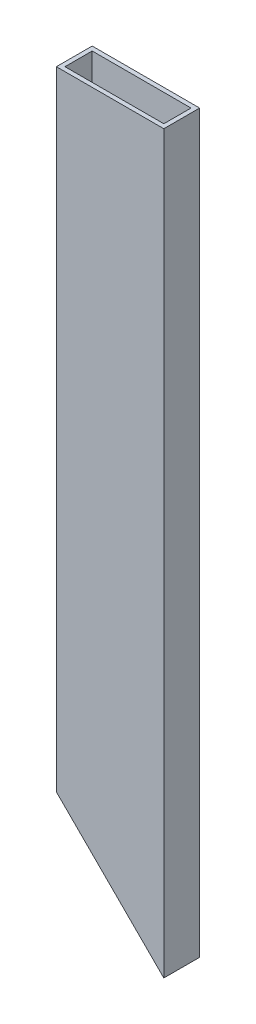
ISO-10303-21;
HEADER;
FILE_DESCRIPTION(('STEP AP214'),'2;1');
FILE_NAME('part.step','',(''),(''),'','','');
FILE_SCHEMA(('AUTOMOTIVE_DESIGN { 1 0 10303 214 1 1 1 1 }'));
ENDSEC;
DATA;
#1=APPLICATION_CONTEXT('core data for automotive mechanical design processes');
#2=APPLICATION_PROTOCOL_DEFINITION('international standard','automotive_design',2000,#1);
#3=PRODUCT_CONTEXT('',#1,'mechanical');
#4=PRODUCT('Part','Part','',(#3));
#5=PRODUCT_RELATED_PRODUCT_CATEGORY('part','',(#4));
#6=PRODUCT_DEFINITION_FORMATION('','',#4);
#7=PRODUCT_DEFINITION_CONTEXT('part definition',#1,'design');
#8=PRODUCT_DEFINITION('design','',#6,#7);
#9=PRODUCT_DEFINITION_SHAPE('','',#8);
#10=(LENGTH_UNIT() NAMED_UNIT(*) SI_UNIT(.MILLI.,.METRE.));
#11=(NAMED_UNIT(*) PLANE_ANGLE_UNIT() SI_UNIT($,.RADIAN.));
#12=(NAMED_UNIT(*) SI_UNIT($,.STERADIAN.) SOLID_ANGLE_UNIT());
#13=UNCERTAINTY_MEASURE_WITH_UNIT(LENGTH_MEASURE(1.E-05),#10,'distance_accuracy_value','');
#14=(GEOMETRIC_REPRESENTATION_CONTEXT(3) GLOBAL_UNCERTAINTY_ASSIGNED_CONTEXT((#13)) GLOBAL_UNIT_ASSIGNED_CONTEXT((#10,
#11,#12)) REPRESENTATION_CONTEXT('',''));
#15=CARTESIAN_POINT('',(0.,0.,0.));
#16=DIRECTION('',(0.,0.,1.));
#17=DIRECTION('',(1.,0.,0.));
#18=AXIS2_PLACEMENT_3D('',#15,#16,#17);
#19=CARTESIAN_POINT('',(-38.1,445.4,-12.7));
#20=DIRECTION('',(1.,0.,0.));
#21=DIRECTION('',(0.,0.,-1.));
#22=AXIS2_PLACEMENT_3D('',#19,#20,#21);
#23=PLANE('',#22);
#24=DIRECTION('',(0.,-1.,0.));
#25=VECTOR('',#24,1.);
#26=CARTESIAN_POINT('',(-38.1,445.4,-12.7));
#27=LINE('',#26,#25);
#28=CARTESIAN_POINT('',(-38.1,483.5,-12.7));
#29=VERTEX_POINT('',#28);
#30=CARTESIAN_POINT('',(-38.1,38.1,-12.7));
#31=VERTEX_POINT('',#30);
#32=EDGE_CURVE('E109',#29,#31,#27,.T.);
#33=ORIENTED_EDGE('',*,*,#32,.T.);
#34=DIRECTION('',(0.,0.,1.));
#35=VECTOR('',#34,1.);
#36=CARTESIAN_POINT('',(-38.1,38.1000000000001,-12.7));
#37=LINE('',#36,#35);
#38=CARTESIAN_POINT('',(-38.1,38.1000000000001,12.7));
#39=VERTEX_POINT('',#38);
#40=EDGE_CURVE('E98',#31,#39,#37,.T.);
#41=ORIENTED_EDGE('',*,*,#40,.T.);
#42=DIRECTION('',(0.,-1.,0.));
#43=VECTOR('',#42,1.);
#44=CARTESIAN_POINT('',(-38.1,445.4,12.7));
#45=LINE('',#44,#43);
#46=CARTESIAN_POINT('',(-38.1,483.5,12.7));
#47=VERTEX_POINT('',#46);
#48=EDGE_CURVE('E11',#47,#39,#45,.T.);
#49=ORIENTED_EDGE('',*,*,#48,.F.);
#50=DIRECTION('',(0.,0.,1.));
#51=VECTOR('',#50,1.);
#52=CARTESIAN_POINT('',(-38.1,483.5,-12.7));
#53=LINE('',#52,#51);
#54=EDGE_CURVE('E115',#29,#47,#53,.T.);
#55=ORIENTED_EDGE('',*,*,#54,.F.);
#56=EDGE_LOOP('',(#33,#41,#49,#55));
#57=FACE_BOUND('',#56,.T.);
#58=ADVANCED_FACE('F36',(#57),#23,.F.);
#59=CARTESIAN_POINT('',(-38.1,445.4,12.7));
#60=DIRECTION('',(0.,0.,-1.));
#61=DIRECTION('',(-1.,0.,0.));
#62=AXIS2_PLACEMENT_3D('',#59,#60,#61);
#63=PLANE('',#62);
#64=ORIENTED_EDGE('',*,*,#48,.T.);
#65=DIRECTION('',(0.707106781186548,-0.707106781186547,0.));
#66=VECTOR('',#65,1.);
#67=CARTESIAN_POINT('',(-241.75,241.75,12.7));
#68=LINE('',#67,#66);
#69=CARTESIAN_POINT('',(38.1000000000001,-38.1,12.7));
#70=VERTEX_POINT('',#69);
#71=EDGE_CURVE('E101',#39,#70,#68,.T.);
#72=ORIENTED_EDGE('',*,*,#71,.T.);
#73=DIRECTION('',(0.,-1.,0.));
#74=VECTOR('',#73,1.);
#75=CARTESIAN_POINT('',(38.1,445.4,12.7));
#76=LINE('',#75,#74);
#77=CARTESIAN_POINT('',(38.1,483.5,12.7));
#78=VERTEX_POINT('',#77);
#79=EDGE_CURVE('E43',#78,#70,#76,.T.);
#80=ORIENTED_EDGE('',*,*,#79,.F.);
#81=DIRECTION('',(1.,0.,0.));
#82=VECTOR('',#81,1.);
#83=CARTESIAN_POINT('',(-38.1,483.5,12.7));
#84=LINE('',#83,#82);
#85=EDGE_CURVE('E135',#47,#78,#84,.T.);
#86=ORIENTED_EDGE('',*,*,#85,.F.);
#87=EDGE_LOOP('',(#64,#72,#80,#86));
#88=FACE_BOUND('',#87,.T.);
#89=ADVANCED_FACE('F134',(#88),#63,.F.);
#90=CARTESIAN_POINT('',(38.1,445.4,-12.7));
#91=DIRECTION('',(-1.,0.,0.));
#92=DIRECTION('',(0.,0.,1.));
#93=AXIS2_PLACEMENT_3D('',#90,#91,#92);
#94=PLANE('',#93);
#95=ORIENTED_EDGE('',*,*,#79,.T.);
#96=DIRECTION('',(0.,0.,1.));
#97=VECTOR('',#96,1.);
#98=CARTESIAN_POINT('',(38.1,-38.1,-12.7));
#99=LINE('',#98,#97);
#100=CARTESIAN_POINT('',(38.1,-38.1,-12.7));
#101=VERTEX_POINT('',#100);
#102=EDGE_CURVE('E128',#101,#70,#99,.T.);
#103=ORIENTED_EDGE('',*,*,#102,.F.);
#104=DIRECTION('',(0.,-1.,0.));
#105=VECTOR('',#104,1.);
#106=CARTESIAN_POINT('',(38.1,445.4,-12.7));
#107=LINE('',#106,#105);
#108=CARTESIAN_POINT('',(38.1,483.5,-12.7));
#109=VERTEX_POINT('',#108);
#110=EDGE_CURVE('E111',#109,#101,#107,.T.);
#111=ORIENTED_EDGE('',*,*,#110,.F.);
#112=DIRECTION('',(0.,0.,-1.));
#113=VECTOR('',#112,1.);
#114=CARTESIAN_POINT('',(38.1,483.5,12.7));
#115=LINE('',#114,#113);
#116=EDGE_CURVE('E130',#78,#109,#115,.T.);
#117=ORIENTED_EDGE('',*,*,#116,.F.);
#118=EDGE_LOOP('',(#95,#103,#111,#117));
#119=FACE_BOUND('',#118,.T.);
#120=ADVANCED_FACE('F127',(#119),#94,.F.);
#121=CARTESIAN_POINT('',(-38.1,445.4,-12.7));
#122=DIRECTION('',(0.,0.,1.));
#123=DIRECTION('',(1.,0.,0.));
#124=AXIS2_PLACEMENT_3D('',#121,#122,#123);
#125=PLANE('',#124);
#126=ORIENTED_EDGE('',*,*,#110,.T.);
#127=DIRECTION('',(-0.707106781186548,0.707106781186547,0.));
#128=VECTOR('',#127,1.);
#129=CARTESIAN_POINT('',(-62.3907736803926,62.3907736803927,-12.7));
#130=LINE('',#129,#128);
#131=EDGE_CURVE('E58',#101,#31,#130,.T.);
#132=ORIENTED_EDGE('',*,*,#131,.T.);
#133=ORIENTED_EDGE('',*,*,#32,.F.);
#134=DIRECTION('',(-1.,0.,0.));
#135=VECTOR('',#134,1.);
#136=CARTESIAN_POINT('',(38.1,483.5,-12.7));
#137=LINE('',#136,#135);
#138=EDGE_CURVE('E141',#109,#29,#137,.T.);
#139=ORIENTED_EDGE('',*,*,#138,.F.);
#140=EDGE_LOOP('',(#126,#132,#133,#139));
#141=FACE_BOUND('',#140,.T.);
#142=ADVANCED_FACE('F107',(#141),#125,.F.);
#143=CARTESIAN_POINT('',(-35.052,445.4,-9.65199999999999));
#144=DIRECTION('',(1.,0.,0.));
#145=DIRECTION('',(0.,0.,-1.));
#146=AXIS2_PLACEMENT_3D('',#143,#144,#145);
#147=PLANE('',#146);
#148=DIRECTION('',(0.,0.,1.));
#149=VECTOR('',#148,1.);
#150=CARTESIAN_POINT('',(-35.052,35.052,-9.65199999999999));
#151=LINE('',#150,#149);
#152=CARTESIAN_POINT('',(-35.052,35.052,-9.65199999999999));
#153=VERTEX_POINT('',#152);
#154=CARTESIAN_POINT('',(-35.052,35.052,9.652));
#155=VERTEX_POINT('',#154);
#156=EDGE_CURVE('E166',#153,#155,#151,.T.);
#157=ORIENTED_EDGE('',*,*,#156,.F.);
#158=DIRECTION('',(0.,-1.,0.));
#159=VECTOR('',#158,1.);
#160=CARTESIAN_POINT('',(-35.052,445.4,-9.65199999999999));
#161=LINE('',#160,#159);
#162=CARTESIAN_POINT('',(-35.052,483.5,-9.65199999999999));
#163=VERTEX_POINT('',#162);
#164=EDGE_CURVE('E146',#163,#153,#161,.T.);
#165=ORIENTED_EDGE('',*,*,#164,.F.);
#166=DIRECTION('',(0.,0.,1.));
#167=VECTOR('',#166,1.);
#168=CARTESIAN_POINT('',(-35.052,483.5,-9.65199999999999));
#169=LINE('',#168,#167);
#170=CARTESIAN_POINT('',(-35.052,483.5,9.652));
#171=VERTEX_POINT('',#170);
#172=EDGE_CURVE('E176',#163,#171,#169,.T.);
#173=ORIENTED_EDGE('',*,*,#172,.T.);
#174=DIRECTION('',(0.,-1.,0.));
#175=VECTOR('',#174,1.);
#176=CARTESIAN_POINT('',(-35.052,445.4,9.652));
#177=LINE('',#176,#175);
#178=EDGE_CURVE('E117',#171,#155,#177,.T.);
#179=ORIENTED_EDGE('',*,*,#178,.T.);
#180=EDGE_LOOP('',(#157,#165,#173,#179));
#181=FACE_BOUND('',#180,.T.);
#182=ADVANCED_FACE('F181',(#181),#147,.T.);
#183=CARTESIAN_POINT('',(-35.052,445.4,9.652));
#184=DIRECTION('',(0.,0.,-1.));
#185=DIRECTION('',(-1.,0.,0.));
#186=AXIS2_PLACEMENT_3D('',#183,#184,#185);
#187=PLANE('',#186);
#188=DIRECTION('',(0.707106781186548,-0.707106781186547,0.));
#189=VECTOR('',#188,1.);
#190=CARTESIAN_POINT('',(-240.226,240.226,9.65200000000003));
#191=LINE('',#190,#189);
#192=CARTESIAN_POINT('',(35.052,-35.052,9.65199999999999));
#193=VERTEX_POINT('',#192);
#194=EDGE_CURVE('E156',#155,#193,#191,.T.);
#195=ORIENTED_EDGE('',*,*,#194,.F.);
#196=ORIENTED_EDGE('',*,*,#178,.F.);
#197=DIRECTION('',(1.,0.,0.));
#198=VECTOR('',#197,1.);
#199=CARTESIAN_POINT('',(-35.052,483.5,9.652));
#200=LINE('',#199,#198);
#201=CARTESIAN_POINT('',(35.052,483.5,9.65199999999999));
#202=VERTEX_POINT('',#201);
#203=EDGE_CURVE('E158',#171,#202,#200,.T.);
#204=ORIENTED_EDGE('',*,*,#203,.T.);
#205=DIRECTION('',(0.,-1.,0.));
#206=VECTOR('',#205,1.);
#207=CARTESIAN_POINT('',(35.052,445.4,9.65199999999999));
#208=LINE('',#207,#206);
#209=EDGE_CURVE('E121',#202,#193,#208,.T.);
#210=ORIENTED_EDGE('',*,*,#209,.T.);
#211=EDGE_LOOP('',(#195,#196,#204,#210));
#212=FACE_BOUND('',#211,.T.);
#213=ADVANCED_FACE('F155',(#212),#187,.T.);
#214=CARTESIAN_POINT('',(35.052,445.4,-9.652));
#215=DIRECTION('',(-1.,0.,0.));
#216=DIRECTION('',(0.,0.,1.));
#217=AXIS2_PLACEMENT_3D('',#214,#215,#216);
#218=PLANE('',#217);
#219=DIRECTION('',(0.,0.,-1.));
#220=VECTOR('',#219,1.);
#221=CARTESIAN_POINT('',(35.052,-35.052,-9.652));
#222=LINE('',#221,#220);
#223=CARTESIAN_POINT('',(35.052,-35.052,-9.652));
#224=VERTEX_POINT('',#223);
#225=EDGE_CURVE('E50',#193,#224,#222,.T.);
#226=ORIENTED_EDGE('',*,*,#225,.F.);
#227=ORIENTED_EDGE('',*,*,#209,.F.);
#228=DIRECTION('',(0.,0.,-1.));
#229=VECTOR('',#228,1.);
#230=CARTESIAN_POINT('',(35.052,483.5,9.65199999999999));
#231=LINE('',#230,#229);
#232=CARTESIAN_POINT('',(35.052,483.5,-9.652));
#233=VERTEX_POINT('',#232);
#234=EDGE_CURVE('E163',#202,#233,#231,.T.);
#235=ORIENTED_EDGE('',*,*,#234,.T.);
#236=DIRECTION('',(0.,-1.,0.));
#237=VECTOR('',#236,1.);
#238=CARTESIAN_POINT('',(35.052,445.4,-9.652));
#239=LINE('',#238,#237);
#240=EDGE_CURVE('E149',#233,#224,#239,.T.);
#241=ORIENTED_EDGE('',*,*,#240,.T.);
#242=EDGE_LOOP('',(#226,#227,#235,#241));
#243=FACE_BOUND('',#242,.T.);
#244=ADVANCED_FACE('F162',(#243),#218,.T.);
#245=CARTESIAN_POINT('',(-35.052,445.4,-9.65199999999999));
#246=DIRECTION('',(0.,0.,1.));
#247=DIRECTION('',(1.,0.,0.));
#248=AXIS2_PLACEMENT_3D('',#245,#246,#247);
#249=PLANE('',#248);
#250=DIRECTION('',(-0.707106781186548,0.707106781186547,0.));
#251=VECTOR('',#250,1.);
#252=CARTESIAN_POINT('',(-240.226,240.226,-9.65199999999996));
#253=LINE('',#252,#251);
#254=EDGE_CURVE('E104',#224,#153,#253,.T.);
#255=ORIENTED_EDGE('',*,*,#254,.F.);
#256=ORIENTED_EDGE('',*,*,#240,.F.);
#257=DIRECTION('',(-1.,0.,0.));
#258=VECTOR('',#257,1.);
#259=CARTESIAN_POINT('',(35.052,483.5,-9.652));
#260=LINE('',#259,#258);
#261=EDGE_CURVE('E173',#233,#163,#260,.T.);
#262=ORIENTED_EDGE('',*,*,#261,.T.);
#263=ORIENTED_EDGE('',*,*,#164,.T.);
#264=EDGE_LOOP('',(#255,#256,#262,#263));
#265=FACE_BOUND('',#264,.T.);
#266=ADVANCED_FACE('F183',(#265),#249,.T.);
#267=CARTESIAN_POINT('',(0.,483.5,0.));
#268=DIRECTION('',(0.,1.,0.));
#269=DIRECTION('',(0.,0.,1.));
#270=AXIS2_PLACEMENT_3D('',#267,#268,#269);
#271=PLANE('',#270);
#272=ORIENTED_EDGE('',*,*,#138,.T.);
#273=ORIENTED_EDGE('',*,*,#54,.T.);
#274=ORIENTED_EDGE('',*,*,#85,.T.);
#275=ORIENTED_EDGE('',*,*,#116,.T.);
#276=EDGE_LOOP('',(#272,#273,#274,#275));
#277=FACE_BOUND('',#276,.T.);
#278=ORIENTED_EDGE('',*,*,#234,.F.);
#279=ORIENTED_EDGE('',*,*,#203,.F.);
#280=ORIENTED_EDGE('',*,*,#172,.F.);
#281=ORIENTED_EDGE('',*,*,#261,.F.);
#282=EDGE_LOOP('',(#278,#279,#280,#281));
#283=FACE_BOUND('',#282,.T.);
#284=ADVANCED_FACE('F137',(#277,#283),#271,.T.);
#285=CARTESIAN_POINT('',(-62.3907736803926,62.3907736803927,-12.7));
#286=DIRECTION('',(0.707106781186547,0.707106781186548,0.));
#287=DIRECTION('',(-0.707106781186548,0.707106781186547,0.));
#288=AXIS2_PLACEMENT_3D('',#285,#286,#287);
#289=PLANE('',#288);
#290=ORIENTED_EDGE('',*,*,#156,.T.);
#291=ORIENTED_EDGE('',*,*,#194,.T.);
#292=ORIENTED_EDGE('',*,*,#225,.T.);
#293=ORIENTED_EDGE('',*,*,#254,.T.);
#294=EDGE_LOOP('',(#290,#291,#292,#293));
#295=FACE_BOUND('',#294,.T.);
#296=ORIENTED_EDGE('',*,*,#131,.F.);
#297=ORIENTED_EDGE('',*,*,#102,.T.);
#298=ORIENTED_EDGE('',*,*,#71,.F.);
#299=ORIENTED_EDGE('',*,*,#40,.F.);
#300=EDGE_LOOP('',(#296,#297,#298,#299));
#301=FACE_BOUND('',#300,.T.);
#302=ADVANCED_FACE('F99',(#295,#301),#289,.F.);
#303=CLOSED_SHELL('',(#58,#89,#120,#142,#182,#213,#244,#266,#284,#302));
#304=MANIFOLD_SOLID_BREP('B2',#303);
#305=ADVANCED_BREP_SHAPE_REPRESENTATION('',(#18,#304),#14);
#306=SHAPE_DEFINITION_REPRESENTATION(#9,#305);
ENDSEC;
END-ISO-10303-21;
